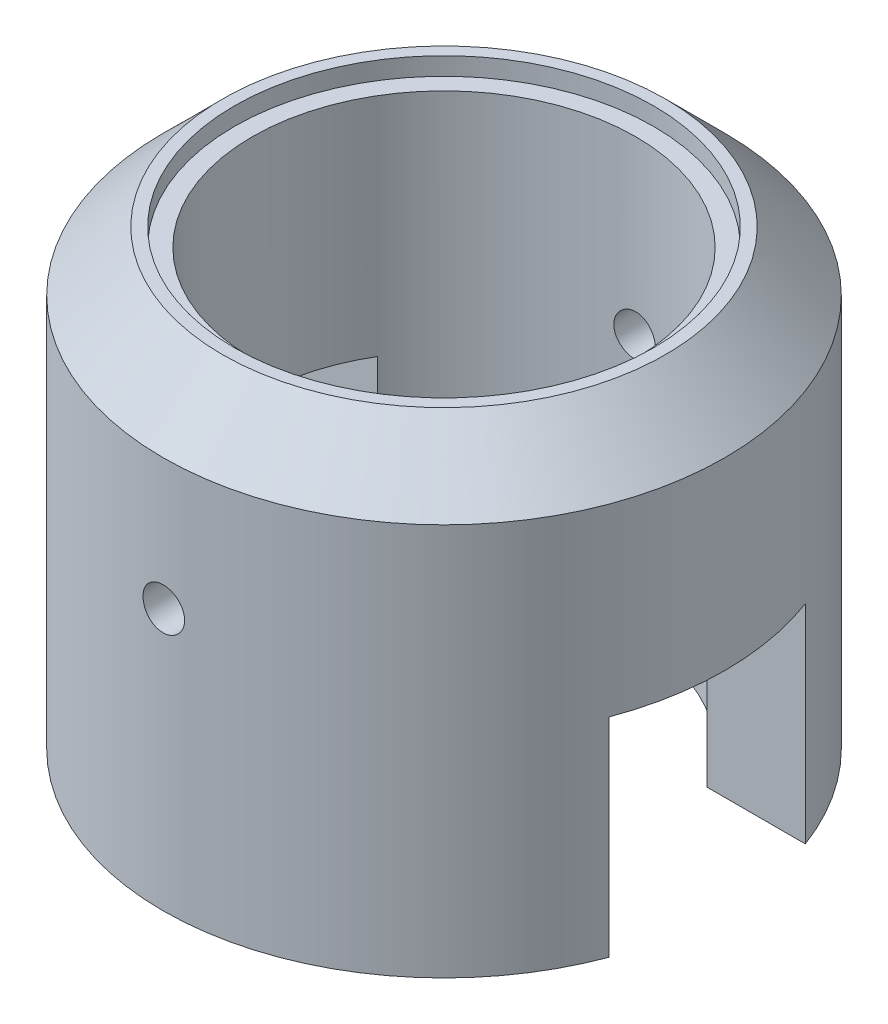
ISO-10303-21;
HEADER;
FILE_DESCRIPTION(('STEP AP214'),'2;1');
FILE_NAME('part.step','',(''),(''),'','','');
FILE_SCHEMA(('AUTOMOTIVE_DESIGN { 1 0 10303 214 1 1 1 1 }'));
ENDSEC;
DATA;
#1=APPLICATION_CONTEXT('core data for automotive mechanical design processes');
#2=APPLICATION_PROTOCOL_DEFINITION('international standard','automotive_design',2000,#1);
#3=PRODUCT_CONTEXT('',#1,'mechanical');
#4=PRODUCT('Part','Part','',(#3));
#5=PRODUCT_RELATED_PRODUCT_CATEGORY('part','',(#4));
#6=PRODUCT_DEFINITION_FORMATION('','',#4);
#7=PRODUCT_DEFINITION_CONTEXT('part definition',#1,'design');
#8=PRODUCT_DEFINITION('design','',#6,#7);
#9=PRODUCT_DEFINITION_SHAPE('','',#8);
#10=(LENGTH_UNIT() NAMED_UNIT(*) SI_UNIT(.MILLI.,.METRE.));
#11=(NAMED_UNIT(*) PLANE_ANGLE_UNIT() SI_UNIT($,.RADIAN.));
#12=(NAMED_UNIT(*) SI_UNIT($,.STERADIAN.) SOLID_ANGLE_UNIT());
#13=UNCERTAINTY_MEASURE_WITH_UNIT(LENGTH_MEASURE(1.E-05),#10,'distance_accuracy_value','');
#14=(GEOMETRIC_REPRESENTATION_CONTEXT(3) GLOBAL_UNCERTAINTY_ASSIGNED_CONTEXT((#13)) GLOBAL_UNIT_ASSIGNED_CONTEXT((#10,
#11,#12)) REPRESENTATION_CONTEXT('',''));
#15=CARTESIAN_POINT('',(0.,0.,0.));
#16=DIRECTION('',(0.,0.,1.));
#17=DIRECTION('',(1.,0.,0.));
#18=AXIS2_PLACEMENT_3D('',#15,#16,#17);
#19=CARTESIAN_POINT('',(-3.225,0.,0.));
#20=DIRECTION('',(0.,-1.,0.));
#21=DIRECTION('',(0.,0.,-1.));
#22=AXIS2_PLACEMENT_3D('',#19,#20,#21);
#23=PLANE('',#22);
#24=DIRECTION('',(1.,0.,0.));
#25=VECTOR('',#24,1.);
#26=CARTESIAN_POINT('',(-4.725,0.,1.65));
#27=LINE('',#26,#25);
#28=CARTESIAN_POINT('',(2.77094298028667,0.,1.65));
#29=VERTEX_POINT('',#28);
#30=CARTESIAN_POINT('',(4.42754164294363,0.,1.65));
#31=VERTEX_POINT('',#30);
#32=EDGE_CURVE('E198',#29,#31,#27,.T.);
#33=ORIENTED_EDGE('',*,*,#32,.T.);
#34=CARTESIAN_POINT('',(0.,0.,0.));
#35=DIRECTION('',(0.,1.,0.));
#36=DIRECTION('',(0.,0.,1.));
#37=AXIS2_PLACEMENT_3D('',#34,#35,#36);
#38=CIRCLE('',#37,4.725);
#39=CARTESIAN_POINT('',(-4.42754164294363,0.,1.65));
#40=VERTEX_POINT('',#39);
#41=EDGE_CURVE('E129',#40,#31,#38,.T.);
#42=ORIENTED_EDGE('',*,*,#41,.F.);
#43=CARTESIAN_POINT('',(-2.77094298028667,0.,1.65));
#44=VERTEX_POINT('',#43);
#45=EDGE_CURVE('E204',#40,#44,#27,.T.);
#46=ORIENTED_EDGE('',*,*,#45,.T.);
#47=CARTESIAN_POINT('',(0.,0.,0.));
#48=DIRECTION('',(0.,1.,0.));
#49=DIRECTION('',(0.,0.,1.));
#50=AXIS2_PLACEMENT_3D('',#47,#48,#49);
#51=CIRCLE('',#50,3.225);
#52=EDGE_CURVE('E201',#44,#29,#51,.T.);
#53=ORIENTED_EDGE('',*,*,#52,.T.);
#54=EDGE_LOOP('',(#33,#42,#46,#53));
#55=FACE_BOUND('',#54,.T.);
#56=ADVANCED_FACE('F33',(#55),#23,.T.);
#57=DIRECTION('',(1.,0.,0.));
#58=VECTOR('',#57,1.);
#59=CARTESIAN_POINT('',(-4.725,0.,-1.65));
#60=LINE('',#59,#58);
#61=CARTESIAN_POINT('',(-4.42754164294363,0.,-1.65));
#62=VERTEX_POINT('',#61);
#63=CARTESIAN_POINT('',(-2.77094298028667,0.,-1.65));
#64=VERTEX_POINT('',#63);
#65=EDGE_CURVE('E63',#62,#64,#60,.T.);
#66=ORIENTED_EDGE('',*,*,#65,.F.);
#67=CARTESIAN_POINT('',(4.42754164294363,0.,-1.65));
#68=VERTEX_POINT('',#67);
#69=EDGE_CURVE('E118',#68,#62,#38,.T.);
#70=ORIENTED_EDGE('',*,*,#69,.F.);
#71=CARTESIAN_POINT('',(2.77094298028667,0.,-1.65));
#72=VERTEX_POINT('',#71);
#73=EDGE_CURVE('E121',#72,#68,#60,.T.);
#74=ORIENTED_EDGE('',*,*,#73,.F.);
#75=EDGE_CURVE('E120',#72,#64,#51,.T.);
#76=ORIENTED_EDGE('',*,*,#75,.T.);
#77=EDGE_LOOP('',(#66,#70,#74,#76));
#78=FACE_BOUND('',#77,.T.);
#79=ADVANCED_FACE('F116',(#78),#23,.T.);
#80=CARTESIAN_POINT('',(0.,7.61175298804781,0.));
#81=DIRECTION('',(0.,1.,0.));
#82=DIRECTION('',(0.,0.,1.));
#83=AXIS2_PLACEMENT_3D('',#80,#81,#82);
#84=CYLINDRICAL_SURFACE('',#83,4.725);
#85=CARTESIAN_POINT('',(0.,4.75,-4.725));
#86=CARTESIAN_POINT('',(0.0196307803127665,4.74999913942152,-4.72499982895336));
#87=CARTESIAN_POINT('',(0.0392751075963471,4.74834287209261,-4.72487635491281));
#88=CARTESIAN_POINT('',(0.0780207681960014,4.74175978618799,-4.72439566360952));
#89=CARTESIAN_POINT('',(0.0971214519922923,4.73682921368375,-4.72403817806377));
#90=CARTESIAN_POINT('',(0.134213023646179,4.72384041682212,-4.72312988228226));
#91=CARTESIAN_POINT('',(0.152204512863294,4.71578390481228,-4.72257917790495));
#92=CARTESIAN_POINT('',(0.186575309976036,4.69677485287914,-4.72134628937063));
#93=CARTESIAN_POINT('',(0.20295497328738,4.68582295337577,-4.72066413429774));
#94=CARTESIAN_POINT('',(0.233675155712827,4.66130969199534,-4.71924339346657));
#95=CARTESIAN_POINT('',(0.248011930767776,4.64774364342597,-4.71850470781522));
#96=CARTESIAN_POINT('',(0.274207284634027,4.61839699100376,-4.71705500486471));
#97=CARTESIAN_POINT('',(0.286065757175712,4.60261629223518,-4.71634398875307));
#98=CARTESIAN_POINT('',(0.306980132976174,4.56926617932446,-4.71502900637774));
#99=CARTESIAN_POINT('',(0.316032814301538,4.55169473937465,-4.71442516352015));
#100=CARTESIAN_POINT('',(0.33105804268377,4.51527608825711,-4.71339395986477));
#101=CARTESIAN_POINT('',(0.3370306339014,4.49642889538486,-4.71296659653672));
#102=CARTESIAN_POINT('',(0.345715458183027,4.45803072741431,-4.71233752444842));
#103=CARTESIAN_POINT('',(0.34843370515483,4.43848111945937,-4.71213539950399));
#104=CARTESIAN_POINT('',(0.350551252407563,4.39920215404244,-4.71197835351203));
#105=CARTESIAN_POINT('',(0.349950603114992,4.37947279931603,-4.7120234287086));
#106=CARTESIAN_POINT('',(0.345452386791524,4.34043548388093,-4.71235531379366));
#107=CARTESIAN_POINT('',(0.341561341865507,4.32112676700682,-4.71264164546812));
#108=CARTESIAN_POINT('',(0.330602911789356,4.28343726877794,-4.71342302737734));
#109=CARTESIAN_POINT('',(0.323535501347106,4.26505649481331,-4.71391807927407));
#110=CARTESIAN_POINT('',(0.30641760662439,4.22972377754283,-4.71506166834972));
#111=CARTESIAN_POINT('',(0.296364180607715,4.21277326453412,-4.71571035675863));
#112=CARTESIAN_POINT('',(0.273561759878824,4.18079787039727,-4.7170879779194));
#113=CARTESIAN_POINT('',(0.260812722211317,4.16577301996121,-4.7178169119499));
#114=CARTESIAN_POINT('',(0.232944322668113,4.13803751739882,-4.71927501191702));
#115=CARTESIAN_POINT('',(0.217819319506647,4.12533253270445,-4.72000417417474));
#116=CARTESIAN_POINT('',(0.185648058523882,4.10264117868184,-4.72137888526351));
#117=CARTESIAN_POINT('',(0.168601799744055,4.09265481070996,-4.72202443405283));
#118=CARTESIAN_POINT('',(0.133068341912814,4.07568457975852,-4.72315926588532));
#119=CARTESIAN_POINT('',(0.114581030897263,4.06870095035527,-4.72364853677121));
#120=CARTESIAN_POINT('',(0.0766918711139293,4.0579383164885,-4.72441553355618));
#121=CARTESIAN_POINT('',(0.0572900373475552,4.05415925947795,-4.724693262924));
#122=CARTESIAN_POINT('',(0.0181717258235845,4.04992010966664,-4.72500543729125));
#123=CARTESIAN_POINT('',(-0.00154389883817433,4.04945218504665,-4.72504045636914));
#124=CARTESIAN_POINT('',(-0.0407733340047606,4.05182809159886,-4.72486479457418));
#125=CARTESIAN_POINT('',(-0.0602871459908696,4.05467189844591,-4.72465411550603));
#126=CARTESIAN_POINT('',(-0.0985368283666493,4.06358405454708,-4.72401113124348));
#127=CARTESIAN_POINT('',(-0.117273544988108,4.06964879131919,-4.72357907435776));
#128=CARTESIAN_POINT('',(-0.153463338515433,4.08482697217911,-4.72254190411821));
#129=CARTESIAN_POINT('',(-0.170916399281297,4.09394045459223,-4.72193678858891));
#130=CARTESIAN_POINT('',(-0.20407920188667,4.11497723265869,-4.72061997860076));
#131=CARTESIAN_POINT('',(-0.219785631637581,4.12690573705792,-4.71990808747158));
#132=CARTESIAN_POINT('',(-0.248975934858004,4.1532264010994,-4.71845843402075));
#133=CARTESIAN_POINT('',(-0.262459777777609,4.16761859460001,-4.71772067134367));
#134=CARTESIAN_POINT('',(-0.286848855518051,4.19849198766152,-4.71630074201573));
#135=CARTESIAN_POINT('',(-0.297748993839142,4.21497721914611,-4.71561868695898));
#136=CARTESIAN_POINT('',(-0.316626343580321,4.24954857205258,-4.71438889231751));
#137=CARTESIAN_POINT('',(-0.324603578882898,4.2676346803925,-4.71384115163536));
#138=CARTESIAN_POINT('',(-0.337399927005736,4.30487607020869,-4.71294257122809));
#139=CARTESIAN_POINT('',(-0.342222201707213,4.32403026029696,-4.71259153441842));
#140=CARTESIAN_POINT('',(-0.348582052043034,4.36287914327276,-4.71212541006648));
#141=CARTESIAN_POINT('',(-0.350119676077243,4.38257382819169,-4.71201031904751));
#142=CARTESIAN_POINT('',(-0.349866067244498,4.42189398487763,-4.71202915239115));
#143=CARTESIAN_POINT('',(-0.34808284389367,4.44151950909133,-4.71216247760172));
#144=CARTESIAN_POINT('',(-0.341254815690448,4.4801915876875,-4.71266184922942));
#145=CARTESIAN_POINT('',(-0.336210005369036,4.4992381410991,-4.71302789603679));
#146=CARTESIAN_POINT('',(-0.323003936548773,4.53621244560843,-4.71395131147182));
#147=CARTESIAN_POINT('',(-0.314842773235223,4.55414023085815,-4.71450867425592));
#148=CARTESIAN_POINT('',(-0.295636632013014,4.58837239046806,-4.71575192110457));
#149=CARTESIAN_POINT('',(-0.284591713428708,4.60467679821469,-4.71643780252516));
#150=CARTESIAN_POINT('',(-0.259901616747517,4.63524025700981,-4.71786275513291));
#151=CARTESIAN_POINT('',(-0.2462505536747,4.64949454841549,-4.71860194429817));
#152=CARTESIAN_POINT('',(-0.216745416526431,4.67551471966652,-4.72004916332084));
#153=CARTESIAN_POINT('',(-0.200890807423258,4.68727999341568,-4.72075718555568));
#154=CARTESIAN_POINT('',(-0.167404141902421,4.70800047135478,-4.72206330571603));
#155=CARTESIAN_POINT('',(-0.149769354110586,4.71695126791565,-4.72266123062214));
#156=CARTESIAN_POINT('',(-0.113255204290085,4.73175365974462,-4.72367764139401));
#157=CARTESIAN_POINT('',(-0.0943773146048871,4.73760884979475,-4.72409633528424));
#158=CARTESIAN_POINT('',(-0.062821701788874,4.74454789695185,-4.7245985474676));
#159=CARTESIAN_POINT('',(-0.0503474343481686,4.74658975366794,-4.72474841466728));
#160=CARTESIAN_POINT('',(-0.0252506463698005,4.74931608061696,-4.72494919584905));
#161=CARTESIAN_POINT('',(-0.0126281261319639,4.75000055359458,-4.72500011003121));
#162=CARTESIAN_POINT('',(0.,4.75,-4.725));
#163=B_SPLINE_CURVE_WITH_KNOTS('',3,(#85,#86,#87,#88,#89,#90,#91,#92,#93,#94,#95,#96,#97,#98,
#99,#100,#101,#102,#103,#104,#105,#106,#107,#108,#109,#110,#111,#112,#113,#114,#115,#116,#117,
#118,#119,#120,#121,#122,#123,#124,#125,#126,#127,#128,#129,#130,#131,#132,#133,#134,#135,#136,
#137,#138,#139,#140,#141,#142,#143,#144,#145,#146,#147,#148,#149,#150,#151,#152,#153,#154,#155,
#156,#157,#158,#159,#160,#161,#162),.UNSPECIFIED.,.T.,.F.,(4,2,2,2,2,2,2,2,2,2,2,2,2,2,2,2,2,2,
2,2,2,2,2,2,2,2,2,2,2,2,2,2,2,2,2,2,2,2,4),(0.,0.0588462375391481,0.11776005791259,
0.176641651547741,0.235510232263811,0.294485352395513,0.353463000861885,0.412508125480255,
0.471552403516166,0.530487400655326,0.589421502353008,0.648239060056712,0.707057086109188,
0.765933251274743,0.824810354718417,0.883829424711778,0.94284852415031,1.00187221372211,
1.06089493543327,1.11977800393315,1.17866063993099,1.23747737426431,1.29629484800141,
1.35522201935593,1.41415000060884,1.47319327083595,1.53223605862089,1.59121958309167,
1.65020223842457,1.70904281833676,1.76788349691289,1.82672237841412,1.88556004958255,
1.94453218908096,2.00351867229135,2.06259707679256,2.12160672479528,2.15946152225211,
2.19731624316468),.UNSPECIFIED.);
#164=CARTESIAN_POINT('',(0.,4.75,-4.725));
#165=VERTEX_POINT('',#164);
#166=EDGE_CURVE('E170',#165,#165,#163,.T.);
#167=ORIENTED_EDGE('',*,*,#166,.F.);
#168=EDGE_LOOP('',(#167));
#169=FACE_BOUND('',#168,.T.);
#170=CARTESIAN_POINT('',(0.,4.05,4.725));
#171=CARTESIAN_POINT('',(0.0196307803127665,4.05000086057848,4.72499982895336));
#172=CARTESIAN_POINT('',(0.039275107596347,4.05165712790739,4.72487635491281));
#173=CARTESIAN_POINT('',(0.0780207681960013,4.05824021381201,4.72439566360952));
#174=CARTESIAN_POINT('',(0.0971214519922923,4.06317078631625,4.72403817806377));
#175=CARTESIAN_POINT('',(0.134213023646179,4.07615958317788,4.72312988228226));
#176=CARTESIAN_POINT('',(0.152204512863294,4.08421609518772,4.72257917790495));
#177=CARTESIAN_POINT('',(0.186575309976036,4.10322514712086,4.72134628937063));
#178=CARTESIAN_POINT('',(0.20295497328738,4.11417704662423,4.72066413429774));
#179=CARTESIAN_POINT('',(0.233675155712827,4.13869030800466,4.71924339346657));
#180=CARTESIAN_POINT('',(0.248011930767776,4.15225635657403,4.71850470781522));
#181=CARTESIAN_POINT('',(0.274207284634027,4.18160300899624,4.71705500486471));
#182=CARTESIAN_POINT('',(0.286065757175712,4.19738370776482,4.71634398875307));
#183=CARTESIAN_POINT('',(0.306980132976174,4.23073382067554,4.71502900637774));
#184=CARTESIAN_POINT('',(0.316032814301539,4.24830526062535,4.71442516352015));
#185=CARTESIAN_POINT('',(0.33105804268377,4.28472391174289,4.71339395986477));
#186=CARTESIAN_POINT('',(0.3370306339014,4.30357110461514,4.71296659653672));
#187=CARTESIAN_POINT('',(0.345715458183027,4.34196927258569,4.71233752444842));
#188=CARTESIAN_POINT('',(0.34843370515483,4.36151888054063,4.71213539950399));
#189=CARTESIAN_POINT('',(0.350551252407563,4.40079784595756,4.71197835351203));
#190=CARTESIAN_POINT('',(0.349950603114992,4.42052720068398,4.7120234287086));
#191=CARTESIAN_POINT('',(0.345452386791524,4.45956451611907,4.71235531379366));
#192=CARTESIAN_POINT('',(0.341561341865507,4.47887323299318,4.71264164546812));
#193=CARTESIAN_POINT('',(0.330602911789356,4.51656273122206,4.71342302737734));
#194=CARTESIAN_POINT('',(0.323535501347106,4.53494350518669,4.71391807927407));
#195=CARTESIAN_POINT('',(0.30641760662439,4.57027622245717,4.71506166834972));
#196=CARTESIAN_POINT('',(0.296364180607715,4.58722673546588,4.71571035675863));
#197=CARTESIAN_POINT('',(0.273561759878824,4.61920212960273,4.7170879779194));
#198=CARTESIAN_POINT('',(0.260812722211317,4.63422698003879,4.7178169119499));
#199=CARTESIAN_POINT('',(0.232944322668113,4.66196248260118,4.71927501191702));
#200=CARTESIAN_POINT('',(0.217819319506647,4.67466746729555,4.72000417417474));
#201=CARTESIAN_POINT('',(0.185648058523882,4.69735882131816,4.72137888526351));
#202=CARTESIAN_POINT('',(0.168601799744055,4.70734518929004,4.72202443405283));
#203=CARTESIAN_POINT('',(0.133068341912814,4.72431542024148,4.72315926588532));
#204=CARTESIAN_POINT('',(0.114581030897263,4.73129904964473,4.72364853677121));
#205=CARTESIAN_POINT('',(0.0766918711139293,4.7420616835115,4.72441553355618));
#206=CARTESIAN_POINT('',(0.0572900373475552,4.74584074052206,4.724693262924));
#207=CARTESIAN_POINT('',(0.0181717258235845,4.75007989033336,4.72500543729125));
#208=CARTESIAN_POINT('',(-0.00154389883817433,4.75054781495335,4.72504045636914));
#209=CARTESIAN_POINT('',(-0.0407733340047606,4.74817190840114,4.72486479457418));
#210=CARTESIAN_POINT('',(-0.0602871459908695,4.74532810155409,4.72465411550603));
#211=CARTESIAN_POINT('',(-0.0985368283666494,4.73641594545292,4.72401113124348));
#212=CARTESIAN_POINT('',(-0.117273544988108,4.73035120868081,4.72357907435776));
#213=CARTESIAN_POINT('',(-0.153463338515433,4.71517302782089,4.72254190411821));
#214=CARTESIAN_POINT('',(-0.170916399281298,4.70605954540777,4.72193678858891));
#215=CARTESIAN_POINT('',(-0.20407920188667,4.68502276734131,4.72061997860076));
#216=CARTESIAN_POINT('',(-0.219785631637581,4.67309426294208,4.71990808747158));
#217=CARTESIAN_POINT('',(-0.248975934858004,4.6467735989006,4.71845843402075));
#218=CARTESIAN_POINT('',(-0.262459777777609,4.63238140539999,4.71772067134367));
#219=CARTESIAN_POINT('',(-0.286848855518051,4.60150801233848,4.71630074201573));
#220=CARTESIAN_POINT('',(-0.297748993839142,4.58502278085389,4.71561868695898));
#221=CARTESIAN_POINT('',(-0.316626343580321,4.55045142794742,4.71438889231751));
#222=CARTESIAN_POINT('',(-0.324603578882898,4.5323653196075,4.71384115163536));
#223=CARTESIAN_POINT('',(-0.337399927005736,4.49512392979132,4.71294257122809));
#224=CARTESIAN_POINT('',(-0.342222201707213,4.47596973970304,4.71259153441842));
#225=CARTESIAN_POINT('',(-0.348582052043034,4.43712085672724,4.71212541006648));
#226=CARTESIAN_POINT('',(-0.350119676077243,4.41742617180831,4.71201031904751));
#227=CARTESIAN_POINT('',(-0.349866067244498,4.37810601512237,4.71202915239115));
#228=CARTESIAN_POINT('',(-0.34808284389367,4.35848049090867,4.71216247760172));
#229=CARTESIAN_POINT('',(-0.341254815690448,4.3198084123125,4.71266184922942));
#230=CARTESIAN_POINT('',(-0.336210005369036,4.3007618589009,4.71302789603679));
#231=CARTESIAN_POINT('',(-0.323003936548773,4.26378755439157,4.71395131147182));
#232=CARTESIAN_POINT('',(-0.314842773235223,4.24585976914185,4.71450867425592));
#233=CARTESIAN_POINT('',(-0.295636632013014,4.21162760953194,4.71575192110457));
#234=CARTESIAN_POINT('',(-0.284591713428707,4.19532320178531,4.71643780252516));
#235=CARTESIAN_POINT('',(-0.259901616747517,4.16475974299019,4.71786275513291));
#236=CARTESIAN_POINT('',(-0.2462505536747,4.15050545158451,4.71860194429817));
#237=CARTESIAN_POINT('',(-0.216745416526431,4.12448528033348,4.72004916332084));
#238=CARTESIAN_POINT('',(-0.200890807423258,4.11272000658432,4.72075718555568));
#239=CARTESIAN_POINT('',(-0.167404141902422,4.09199952864522,4.72206330571603));
#240=CARTESIAN_POINT('',(-0.149769354110587,4.08304873208436,4.72266123062214));
#241=CARTESIAN_POINT('',(-0.113255204290085,4.06824634025538,4.72367764139401));
#242=CARTESIAN_POINT('',(-0.0943773146048872,4.06239115020525,4.72409633528424));
#243=CARTESIAN_POINT('',(-0.062821701788874,4.05545210304815,4.7245985474676));
#244=CARTESIAN_POINT('',(-0.0503474343481686,4.05341024633206,4.72474841466728));
#245=CARTESIAN_POINT('',(-0.0252506463698005,4.05068391938304,4.72494919584905));
#246=CARTESIAN_POINT('',(-0.0126281261319639,4.04999944640542,4.72500011003121));
#247=CARTESIAN_POINT('',(0.,4.05,4.725));
#248=B_SPLINE_CURVE_WITH_KNOTS('',3,(#170,#171,#172,#173,#174,#175,#176,#177,#178,#179,#180,
#181,#182,#183,#184,#185,#186,#187,#188,#189,#190,#191,#192,#193,#194,#195,#196,#197,#198,#199,
#200,#201,#202,#203,#204,#205,#206,#207,#208,#209,#210,#211,#212,#213,#214,#215,#216,#217,#218,
#219,#220,#221,#222,#223,#224,#225,#226,#227,#228,#229,#230,#231,#232,#233,#234,#235,#236,#237,
#238,#239,#240,#241,#242,#243,#244,#245,#246,#247),.UNSPECIFIED.,.T.,.F.,(4,2,2,2,2,2,2,2,2,2,2,
2,2,2,2,2,2,2,2,2,2,2,2,2,2,2,2,2,2,2,2,2,2,2,2,2,2,2,4),(0.,0.0588462375391479,
0.11776005791259,0.176641651547741,0.235510232263811,0.294485352395514,0.353463000861885,
0.412508125480255,0.471552403516166,0.530487400655326,0.589421502353008,0.648239060056712,
0.707057086109188,0.765933251274743,0.824810354718417,0.883829424711778,0.94284852415031,
1.00187221372211,1.06089493543327,1.11977800393315,1.17866063993099,1.23747737426431,
1.29629484800141,1.35522201935593,1.41415000060884,1.47319327083595,1.53223605862089,
1.59121958309167,1.65020223842457,1.70904281833676,1.76788349691289,1.82672237841412,
1.88556004958255,1.94453218908096,2.00351867229135,2.06259707679256,2.12160672479528,
2.15946152225211,2.19731624316468),.UNSPECIFIED.);
#249=CARTESIAN_POINT('',(0.,4.05,4.725));
#250=VERTEX_POINT('',#249);
#251=EDGE_CURVE('E176',#250,#250,#248,.T.);
#252=ORIENTED_EDGE('',*,*,#251,.F.);
#253=EDGE_LOOP('',(#252));
#254=FACE_BOUND('',#253,.T.);
#255=DIRECTION('',(0.,1.,0.));
#256=VECTOR('',#255,1.);
#257=CARTESIAN_POINT('',(-4.42754164294363,7.61175298804781,1.65));
#258=LINE('',#257,#256);
#259=CARTESIAN_POINT('',(-4.42754164294363,3.5,1.65));
#260=VERTEX_POINT('',#259);
#261=EDGE_CURVE('E208',#40,#260,#258,.T.);
#262=ORIENTED_EDGE('',*,*,#261,.F.);
#263=ORIENTED_EDGE('',*,*,#41,.T.);
#264=DIRECTION('',(0.,1.,0.));
#265=VECTOR('',#264,1.);
#266=CARTESIAN_POINT('',(4.42754164294363,7.61175298804781,1.65));
#267=LINE('',#266,#265);
#268=CARTESIAN_POINT('',(4.42754164294363,3.5,1.65));
#269=VERTEX_POINT('',#268);
#270=EDGE_CURVE('E207',#269,#31,#267,.F.);
#271=ORIENTED_EDGE('',*,*,#270,.F.);
#272=CARTESIAN_POINT('',(0.,3.5,0.));
#273=DIRECTION('',(0.,1.,0.));
#274=DIRECTION('',(0.,0.,1.));
#275=AXIS2_PLACEMENT_3D('',#272,#273,#274);
#276=CIRCLE('',#275,4.725);
#277=CARTESIAN_POINT('',(4.42754164294363,3.5,-1.65));
#278=VERTEX_POINT('',#277);
#279=EDGE_CURVE('E110',#278,#269,#276,.F.);
#280=ORIENTED_EDGE('',*,*,#279,.F.);
#281=DIRECTION('',(0.,1.,0.));
#282=VECTOR('',#281,1.);
#283=CARTESIAN_POINT('',(4.42754164294363,7.61175298804781,-1.65));
#284=LINE('',#283,#282);
#285=EDGE_CURVE('E111',#68,#278,#284,.T.);
#286=ORIENTED_EDGE('',*,*,#285,.F.);
#287=ORIENTED_EDGE('',*,*,#69,.T.);
#288=DIRECTION('',(0.,1.,0.));
#289=VECTOR('',#288,1.);
#290=CARTESIAN_POINT('',(-4.42754164294363,7.61175298804781,-1.65));
#291=LINE('',#290,#289);
#292=CARTESIAN_POINT('',(-4.42754164294363,3.5,-1.65));
#293=VERTEX_POINT('',#292);
#294=EDGE_CURVE('E103',#293,#62,#291,.F.);
#295=ORIENTED_EDGE('',*,*,#294,.F.);
#296=EDGE_CURVE('E209',#260,#293,#276,.F.);
#297=ORIENTED_EDGE('',*,*,#296,.F.);
#298=EDGE_LOOP('',(#262,#263,#271,#280,#286,#287,#295,#297));
#299=FACE_BOUND('',#298,.T.);
#300=CARTESIAN_POINT('',(0.,6.6,0.));
#301=DIRECTION('',(0.,1.,0.));
#302=DIRECTION('',(0.,0.,1.));
#303=AXIS2_PLACEMENT_3D('',#300,#301,#302);
#304=CIRCLE('',#303,4.725);
#305=CARTESIAN_POINT('',(0.,6.6,4.725));
#306=VERTEX_POINT('',#305);
#307=EDGE_CURVE('E132',#306,#306,#304,.F.);
#308=ORIENTED_EDGE('',*,*,#307,.T.);
#309=EDGE_LOOP('',(#308));
#310=FACE_BOUND('',#309,.T.);
#311=ADVANCED_FACE('F125',(#169,#254,#299,#310),#84,.T.);
#312=CARTESIAN_POINT('',(-4.725,7.6,0.));
#313=DIRECTION('',(0.,1.,0.));
#314=DIRECTION('',(0.,0.,1.));
#315=AXIS2_PLACEMENT_3D('',#312,#313,#314);
#316=PLANE('',#315);
#317=CARTESIAN_POINT('',(0.,7.6,0.));
#318=DIRECTION('',(0.,1.,0.));
#319=DIRECTION('',(0.,0.,1.));
#320=AXIS2_PLACEMENT_3D('',#317,#318,#319);
#321=CIRCLE('',#320,3.725);
#322=CARTESIAN_POINT('',(0.,7.6,3.725));
#323=VERTEX_POINT('',#322);
#324=EDGE_CURVE('E128',#323,#323,#321,.T.);
#325=ORIENTED_EDGE('',*,*,#324,.T.);
#326=EDGE_LOOP('',(#325));
#327=FACE_BOUND('',#326,.T.);
#328=CARTESIAN_POINT('',(0.,7.6,0.));
#329=DIRECTION('',(0.,1.,0.));
#330=DIRECTION('',(0.,0.,1.));
#331=AXIS2_PLACEMENT_3D('',#328,#329,#330);
#332=CIRCLE('',#331,3.525);
#333=CARTESIAN_POINT('',(0.,7.6,3.525));
#334=VERTEX_POINT('',#333);
#335=EDGE_CURVE('E135',#334,#334,#332,.T.);
#336=ORIENTED_EDGE('',*,*,#335,.F.);
#337=EDGE_LOOP('',(#336));
#338=FACE_BOUND('',#337,.T.);
#339=ADVANCED_FACE('F184',(#327,#338),#316,.T.);
#340=CARTESIAN_POINT('',(0.,7.61175298804781,0.));
#341=DIRECTION('',(0.,1.,0.));
#342=DIRECTION('',(0.,0.,1.));
#343=AXIS2_PLACEMENT_3D('',#340,#341,#342);
#344=CYLINDRICAL_SURFACE('',#343,3.525);
#345=ORIENTED_EDGE('',*,*,#335,.T.);
#346=EDGE_LOOP('',(#345));
#347=FACE_BOUND('',#346,.T.);
#348=CARTESIAN_POINT('',(0.,7.3,0.));
#349=DIRECTION('',(0.,1.,0.));
#350=DIRECTION('',(0.,0.,1.));
#351=AXIS2_PLACEMENT_3D('',#348,#349,#350);
#352=CIRCLE('',#351,3.525);
#353=CARTESIAN_POINT('',(0.,7.3,3.525));
#354=VERTEX_POINT('',#353);
#355=EDGE_CURVE('E220',#354,#354,#352,.T.);
#356=ORIENTED_EDGE('',*,*,#355,.F.);
#357=EDGE_LOOP('',(#356));
#358=FACE_BOUND('',#357,.T.);
#359=ADVANCED_FACE('F227',(#347,#358),#344,.F.);
#360=CARTESIAN_POINT('',(-3.525,7.3,0.));
#361=DIRECTION('',(0.,1.,0.));
#362=DIRECTION('',(0.,0.,1.));
#363=AXIS2_PLACEMENT_3D('',#360,#361,#362);
#364=PLANE('',#363);
#365=ORIENTED_EDGE('',*,*,#355,.T.);
#366=EDGE_LOOP('',(#365));
#367=FACE_BOUND('',#366,.T.);
#368=CARTESIAN_POINT('',(0.,7.3,0.));
#369=DIRECTION('',(0.,1.,0.));
#370=DIRECTION('',(0.,0.,1.));
#371=AXIS2_PLACEMENT_3D('',#368,#369,#370);
#372=CIRCLE('',#371,3.225);
#373=CARTESIAN_POINT('',(0.,7.3,3.225));
#374=VERTEX_POINT('',#373);
#375=EDGE_CURVE('E218',#374,#374,#372,.T.);
#376=ORIENTED_EDGE('',*,*,#375,.F.);
#377=EDGE_LOOP('',(#376));
#378=FACE_BOUND('',#377,.T.);
#379=ADVANCED_FACE('F235',(#367,#378),#364,.T.);
#380=CARTESIAN_POINT('',(0.,7.61175298804781,0.));
#381=DIRECTION('',(0.,1.,0.));
#382=DIRECTION('',(0.,0.,1.));
#383=AXIS2_PLACEMENT_3D('',#380,#381,#382);
#384=CYLINDRICAL_SURFACE('',#383,3.225);
#385=CARTESIAN_POINT('',(0.,4.05,3.225));
#386=CARTESIAN_POINT('',(-0.0195978257264568,4.0500008439481,3.22499975745281));
#387=CARTESIAN_POINT('',(-0.0392083842261659,4.05165157928419,3.22481946600589));
#388=CARTESIAN_POINT('',(-0.0778851827957588,4.05821140687677,3.22411758585404));
#389=CARTESIAN_POINT('',(-0.096950809707046,4.06312402966239,3.22359562735179));
#390=CARTESIAN_POINT('',(-0.13397211433738,4.07606237825496,3.22226929546476));
#391=CARTESIAN_POINT('',(-0.15192847868854,4.08408615541567,3.22146509888735));
#392=CARTESIAN_POINT('',(-0.1862358840696,4.10301510601141,3.21966406171853));
#393=CARTESIAN_POINT('',(-0.202587229565288,4.11391973150639,3.2186672577709));
#394=CARTESIAN_POINT('',(-0.233292930701064,4.13834995977915,3.21658786477287));
#395=CARTESIAN_POINT('',(-0.247639581939473,4.15188522080208,3.21550496857247));
#396=CARTESIAN_POINT('',(-0.273862380092046,4.18117184521221,3.21337795959126));
#397=CARTESIAN_POINT('',(-0.285738409200634,4.19692331421388,3.21233384866179));
#398=CARTESIAN_POINT('',(-0.306710632099718,4.23024410166153,3.21039953645401));
#399=CARTESIAN_POINT('',(-0.315799768048098,4.24781788712454,3.2095097283828));
#400=CARTESIAN_POINT('',(-0.330895131084699,4.28425356374858,3.20798867114231));
#401=CARTESIAN_POINT('',(-0.336901447113741,4.30311541773041,3.20735741451381));
#402=CARTESIAN_POINT('',(-0.345637629638677,4.3415127225185,3.20642777111572));
#403=CARTESIAN_POINT('',(-0.348380359663222,4.36104521443552,3.20612807780917));
#404=CARTESIAN_POINT('',(-0.35055129082921,4.40029540195232,3.20589145964697));
#405=CARTESIAN_POINT('',(-0.349979593641544,4.42001309185257,3.20595452366366));
#406=CARTESIAN_POINT('',(-0.345548487023933,4.45898498337646,3.20643510035808));
#407=CARTESIAN_POINT('',(-0.341703161813081,4.47824080774265,3.20685109458823));
#408=CARTESIAN_POINT('',(-0.330855887614246,4.51583218119189,3.2079882896528));
#409=CARTESIAN_POINT('',(-0.323853889187416,4.53416771585663,3.20870949526732));
#410=CARTESIAN_POINT('',(-0.306876612825876,4.56944228983861,3.21037759189797));
#411=CARTESIAN_POINT('',(-0.296895126905914,4.58637831816996,3.21132495329302));
#412=CARTESIAN_POINT('',(-0.274246667499726,4.6183401650811,3.21333823250725));
#413=CARTESIAN_POINT('',(-0.261579601382064,4.63336591774277,3.21440415441523));
#414=CARTESIAN_POINT('',(-0.23384108171048,4.661162501009,3.21654121521648));
#415=CARTESIAN_POINT('',(-0.218757472059324,4.67392120417841,3.21761235242639));
#416=CARTESIAN_POINT('',(-0.186656131140233,4.6967273832559,3.219633938536));
#417=CARTESIAN_POINT('',(-0.169638397074953,4.70677485524263,3.22058438726114));
#418=CARTESIAN_POINT('',(-0.134143175197159,4.72387303094949,3.22225790137195));
#419=CARTESIAN_POINT('',(-0.115665366542379,4.73092307381948,3.22298091660569));
#420=CARTESIAN_POINT('',(-0.077778675889027,4.74181714532163,3.22411760928316));
#421=CARTESIAN_POINT('',(-0.0583698267281554,4.7456612869378,3.2245312976283));
#422=CARTESIAN_POINT('',(-0.0192769724355813,4.75001894449306,3.22500131994106));
#423=CARTESIAN_POINT('',(0.000405147593880948,4.75054918618112,3.22505944844073));
#424=CARTESIAN_POINT('',(0.0395779683098623,4.74830798838529,3.22481662404654));
#425=CARTESIAN_POINT('',(0.0590686720462853,4.74553660159375,3.22451567688335));
#426=CARTESIAN_POINT('',(0.0972567745413006,4.73678469878291,3.22358965381632));
#427=CARTESIAN_POINT('',(0.115955999457192,4.73081205970133,3.22296537362578));
#428=CARTESIAN_POINT('',(0.152087221970465,4.71583531827839,3.22146267171258));
#429=CARTESIAN_POINT('',(0.169519186409548,4.70683113665036,3.22058424334305));
#430=CARTESIAN_POINT('',(0.202696390102015,4.68600574691704,3.21866692212348));
#431=CARTESIAN_POINT('',(0.218434728884995,4.67417360334418,3.21762741201274));
#432=CARTESIAN_POINT('',(0.247707964960886,4.64804377378471,3.21550642688786));
#433=CARTESIAN_POINT('',(0.261242796871475,4.63374601466442,3.21442495062969));
#434=CARTESIAN_POINT('',(0.285783292570966,4.60301761049848,3.21233647826933));
#435=CARTESIAN_POINT('',(0.29677794379659,4.58657814439387,3.21132981884721));
#436=CARTESIAN_POINT('',(0.315850157569023,4.55207626561397,3.20951022041882));
#437=CARTESIAN_POINT('',(0.32392776605946,4.53401387850538,3.20869727836155));
#438=CARTESIAN_POINT('',(0.336918355404544,4.49681594067082,3.20735933007705));
#439=CARTESIAN_POINT('',(0.341837779635925,4.4776826621142,3.20683373792148));
#440=CARTESIAN_POINT('',(0.348393215944897,4.43885562662184,3.20612822777573));
#441=CARTESIAN_POINT('',(0.350029340523448,4.41916188891346,3.20594829794157));
#442=CARTESIAN_POINT('',(0.34997001450109,4.3798824516433,3.20595476614561));
#443=CARTESIAN_POINT('',(0.348291862875006,4.36029672335795,3.2061392620523));
#444=CARTESIAN_POINT('',(0.34168800662934,4.32168726214058,3.20684972751314));
#445=CARTESIAN_POINT('',(0.336762299276003,4.30266352968166,3.20737569735475));
#446=CARTESIAN_POINT('',(0.32380813539394,4.26571889575422,3.2087093005986));
#447=CARTESIAN_POINT('',(0.315780292170381,4.2477977771057,3.20951687832271));
#448=CARTESIAN_POINT('',(0.296851480997618,4.21355445528746,3.21132281061908));
#449=CARTESIAN_POINT('',(0.28595051248576,4.19723225243087,3.2123211652287));
#450=CARTESIAN_POINT('',(0.261520120417517,4.16656147087776,3.21440240947459));
#451=CARTESIAN_POINT('',(0.247977794382843,4.1522231961188,3.21548569779543));
#452=CARTESIAN_POINT('',(0.218675262327659,4.12601543633854,3.21761113999967));
#453=CARTESIAN_POINT('',(0.202914528670453,4.11414654031524,3.21865328402139));
#454=CARTESIAN_POINT('',(0.169571359368531,4.09318638002661,3.22058225013662));
#455=CARTESIAN_POINT('',(0.151983749542348,4.08410330986021,3.22146861081267));
#456=CARTESIAN_POINT('',(0.115534099165229,4.06903178768258,3.22298126514787));
#457=CARTESIAN_POINT('',(0.0966735058018402,4.06303988632686,3.22360784853085));
#458=CARTESIAN_POINT('',(0.0647574446238091,4.05579608996465,3.22437491788132));
#459=CARTESIAN_POINT('',(0.0519051884833692,4.0536255740622,3.22460821528022));
#460=CARTESIAN_POINT('',(0.0260371613784482,4.05072725236628,3.22492083652694));
#461=CARTESIAN_POINT('',(0.0130213912436693,4.04999943925523,3.22500016115572));
#462=CARTESIAN_POINT('',(0.,4.05,3.225));
#463=B_SPLINE_CURVE_WITH_KNOTS('',3,(#385,#386,#387,#388,#389,#390,#391,#392,#393,#394,#395,
#396,#397,#398,#399,#400,#401,#402,#403,#404,#405,#406,#407,#408,#409,#410,#411,#412,#413,#414,
#415,#416,#417,#418,#419,#420,#421,#422,#423,#424,#425,#426,#427,#428,#429,#430,#431,#432,#433,
#434,#435,#436,#437,#438,#439,#440,#441,#442,#443,#444,#445,#446,#447,#448,#449,#450,#451,#452,
#453,#454,#455,#456,#457,#458,#459,#460,#461,#462),.UNSPECIFIED.,.T.,.F.,(4,2,2,2,2,2,2,2,2,2,2,
2,2,2,2,2,2,2,2,2,2,2,2,2,2,2,2,2,2,2,2,2,2,2,2,2,2,2,4),(0.,0.0587459236828989,
0.117555535346317,0.176328371434924,0.235090036913056,0.294071663538388,0.353056101914095,
0.41218870829211,0.471319608570384,0.530216662222324,0.589111909201849,0.647755042702099,
0.706399094685011,0.765166199117644,0.823935330883958,0.883009953528354,0.942084661614094,
1.00117238729217,1.06025803048253,1.11904521714224,1.1778314656001,1.23647372540168,
1.29511751904593,1.3539918601482,1.41286794784807,1.47199468476141,1.53112049038387,
1.59012528000459,1.64912804781504,1.70782366257152,1.76651932673735,1.82520339245842,
1.88388746967175,1.94286572961281,2.00185804100409,2.06102224141215,2.1201202786438,
2.15915305436602,2.19818563210821),.UNSPECIFIED.);
#464=CARTESIAN_POINT('',(0.,4.05,3.225));
#465=VERTEX_POINT('',#464);
#466=EDGE_CURVE('E37',#465,#465,#463,.T.);
#467=ORIENTED_EDGE('',*,*,#466,.F.);
#468=EDGE_LOOP('',(#467));
#469=FACE_BOUND('',#468,.T.);
#470=CARTESIAN_POINT('',(0.35,4.4,-3.20595149682586));
#471=CARTESIAN_POINT('',(0.349999155710907,4.41959744253314,-3.20595174475069));
#472=CARTESIAN_POINT('',(0.348348482746948,4.43920761901834,-3.20613312841295));
#473=CARTESIAN_POINT('',(0.341788925414885,4.47788362389009,-3.20683890962964));
#474=CARTESIAN_POINT('',(0.336876509183952,4.49694883881741,-3.20736367899815));
#475=CARTESIAN_POINT('',(0.323938764801328,4.53396927220951,-3.20869610672547));
#476=CARTESIAN_POINT('',(0.315915395108412,4.55192518079461,-3.20950358707643));
#477=CARTESIAN_POINT('',(0.296987404140263,4.58623182217443,-3.21131023664456));
#478=CARTESIAN_POINT('',(0.286083329808249,4.60258285886976,-3.2123093694639));
#479=CARTESIAN_POINT('',(0.261653658873895,4.63328890731814,-3.21439150968505));
#480=CARTESIAN_POINT('',(0.248118280835828,4.64763611718659,-3.21547482069483));
#481=CARTESIAN_POINT('',(0.218831187654481,4.67385999390002,-3.21760050873738));
#482=CARTESIAN_POINT('',(0.20307936842321,4.68573654465354,-3.21864288384479));
#483=CARTESIAN_POINT('',(0.169758272741348,4.70670931412971,-3.22057229293847));
#484=CARTESIAN_POINT('',(0.152184589509958,4.71579857051386,-3.221458935603));
#485=CARTESIAN_POINT('',(0.1157491350431,4.73089418439275,-3.22297366310937));
#486=CARTESIAN_POINT('',(0.096887400394007,4.73690062941179,-3.22360175529163));
#487=CARTESIAN_POINT('',(0.0584904665219155,4.74563707985977,-3.22452647899051));
#488=CARTESIAN_POINT('',(0.0389582286877439,4.74837996064614,-3.22482441272087));
#489=CARTESIAN_POINT('',(-0.00029146092807464,4.75055128137436,-3.22505968554619));
#490=CARTESIAN_POINT('',(-0.0200089071021841,4.74997982134336,-3.22499703552361));
#491=CARTESIAN_POINT('',(-0.0589818416895719,4.74554909125345,-3.22451926161994));
#492=CARTESIAN_POINT('',(-0.0782389248996383,4.74170366664678,-3.22410562208272));
#493=CARTESIAN_POINT('',(-0.115832764678639,4.73085575772015,-3.22297404078457));
#494=CARTESIAN_POINT('',(-0.1341695074887,4.7238532262178,-3.22225609447584));
#495=CARTESIAN_POINT('',(-0.169445550087576,4.7068748439308,-3.22059404343587));
#496=CARTESIAN_POINT('',(-0.186381899010303,4.69689290917986,-3.21964947672573));
#497=CARTESIAN_POINT('',(-0.218344196963831,4.67424349067528,-3.21764007613934));
#498=CARTESIAN_POINT('',(-0.233370079918499,4.66157591407535,-3.21657523810574));
#499=CARTESIAN_POINT('',(-0.261166090504695,4.63383703101459,-3.21443821125316));
#500=CARTESIAN_POINT('',(-0.27392419365693,4.61875367300772,-3.21336601283304));
#501=CARTESIAN_POINT('',(-0.296729281832194,4.58665304981789,-3.21134056500054));
#502=CARTESIAN_POINT('',(-0.306776261683199,4.56963578094569,-3.21038731581507));
#503=CARTESIAN_POINT('',(-0.323874082852649,4.53414068778608,-3.20870764711751));
#504=CARTESIAN_POINT('',(-0.330924111816269,4.51566246910066,-3.20798128912076));
#505=CARTESIAN_POINT('',(-0.341818029979459,4.47777488679114,-3.20683889630034));
#506=CARTESIAN_POINT('',(-0.345662034667392,4.45836555673444,-3.20642285029858));
#507=CARTESIAN_POINT('',(-0.350019175432791,4.4192724744763,-3.20595016233318));
#508=CARTESIAN_POINT('',(-0.350549165274035,4.39959062183252,-3.20589170186467));
#509=CARTESIAN_POINT('',(-0.3483075592188,4.36041839629075,-3.20613600233131));
#510=CARTESIAN_POINT('',(-0.345536016030649,4.34092802034088,-3.20643875749973));
#511=CARTESIAN_POINT('',(-0.33678414732578,4.30274157007158,-3.20736972077175));
#512=CARTESIAN_POINT('',(-0.330811851517643,4.28404363388233,-3.2079971143217));
#513=CARTESIAN_POINT('',(-0.315836227968545,4.24791483706248,-3.20950600307286));
#514=CARTESIAN_POINT('',(-0.306832818911455,4.23048401044008,-3.21038750509098));
#515=CARTESIAN_POINT('',(-0.286008570292069,4.19730758909736,-3.2123096764438));
#516=CARTESIAN_POINT('',(-0.274176599085492,4.18156901817036,-3.21335096867489));
#517=CARTESIAN_POINT('',(-0.248046977668099,4.15229523348597,-3.21547338233352));
#518=CARTESIAN_POINT('',(-0.233749255465468,4.13876008408366,-3.21655450492326));
#519=CARTESIAN_POINT('',(-0.203020714189214,4.11421889217885,-3.21864028575763));
#520=CARTESIAN_POINT('',(-0.186581067202969,4.10322386981406,-3.2196445986278));
#521=CARTESIAN_POINT('',(-0.152078726727612,4.08415100502742,-3.22145853236738));
#522=CARTESIAN_POINT('',(-0.134016058880867,4.07607311652743,-3.22226815631197));
#523=CARTESIAN_POINT('',(-0.096818290048538,4.063082344197,-3.22359993930344));
#524=CARTESIAN_POINT('',(-0.0776855039011295,4.05816289564997,-3.22412269426745));
#525=CARTESIAN_POINT('',(-0.0388595077320133,4.05160724389385,-3.22482429421803));
#526=CARTESIAN_POINT('',(-0.0191663164850541,4.04997093082384,-3.2250031507122));
#527=CARTESIAN_POINT('',(0.0201134363518553,4.05002970273892,-3.22499678050813));
#528=CARTESIAN_POINT('',(0.0397000260098582,4.05170771718619,-3.22481341942111));
#529=CARTESIAN_POINT('',(0.0783112444695596,4.05831160189595,-3.22410690417231));
#530=CARTESIAN_POINT('',(0.0973358730604427,4.06323747337684,-3.22358374988305));
#531=CARTESIAN_POINT('',(0.134282318500671,4.07619230829302,-3.22225622743824));
#532=CARTESIAN_POINT('',(0.152204348837332,4.0842206688122,-3.22145191392411));
#533=CARTESIAN_POINT('',(0.186449278470863,4.1031507971551,-3.21965154129879));
#534=CARTESIAN_POINT('',(0.202772178020608,4.11405256452444,-3.21865548221792));
#535=CARTESIAN_POINT('',(0.233442931110518,4.13848384032489,-3.21657694470113));
#536=CARTESIAN_POINT('',(0.247780625829456,4.15202606818551,-3.21549406352636));
#537=CARTESIAN_POINT('',(0.273987261139728,4.18132816452934,-3.21336728763002));
#538=CARTESIAN_POINT('',(0.285855611206181,4.19708856196364,-3.21232340228286));
#539=CARTESIAN_POINT('',(0.306815177992706,4.23043145224245,-3.21038952441211));
#540=CARTESIAN_POINT('',(0.315898104088946,4.24801917995314,-3.20949999466424));
#541=CARTESIAN_POINT('',(0.330969324350744,4.2844690793068,-3.20798101676175));
#542=CARTESIAN_POINT('',(0.336961069743773,4.30332980294931,-3.20735127871421));
#543=CARTESIAN_POINT('',(0.34420443072793,4.33524544765193,-3.20658014311909));
#544=CARTESIAN_POINT('',(0.346374750650509,4.34809712630644,-3.20634553408914));
#545=CARTESIAN_POINT('',(0.349272812028832,4.3739639967558,-3.20603112898116));
#546=CARTESIAN_POINT('',(0.35000056095737,4.38697918770328,-3.20595133210118));
#547=CARTESIAN_POINT('',(0.35,4.4,-3.20595149682586));
#548=B_SPLINE_CURVE_WITH_KNOTS('',3,(#470,#471,#472,#473,#474,#475,#476,#477,#478,#479,#480,
#481,#482,#483,#484,#485,#486,#487,#488,#489,#490,#491,#492,#493,#494,#495,#496,#497,#498,#499,
#500,#501,#502,#503,#504,#505,#506,#507,#508,#509,#510,#511,#512,#513,#514,#515,#516,#517,#518,
#519,#520,#521,#522,#523,#524,#525,#526,#527,#528,#529,#530,#531,#532,#533,#534,#535,#536,#537,
#538,#539,#540,#541,#542,#543,#544,#545,#546,#547),.UNSPECIFIED.,.T.,.F.,(4,2,2,2,2,2,2,2,2,2,2,
2,2,2,2,2,2,2,2,2,2,2,2,2,2,2,2,2,2,2,2,2,2,2,2,2,2,2,4),(0.,0.0587447726108663,
0.117553258872921,0.176324782998891,0.235085156514918,0.294068289558001,0.353054193478171,
0.412186259232345,0.471316646071576,0.530212970939846,0.589107518320213,0.647754233355519,
0.706401824884458,0.765170004276611,0.823940215695741,0.883013308624355,0.942086514246217,
1.00117572208273,1.06026280129825,1.11904914104099,1.17783454228394,1.23647315458303,
1.29511334011431,1.35398821404961,1.41286480722856,1.47199222609034,1.53111871095276,
1.59012190202108,1.64912311868034,1.70782124028157,1.76651938390267,1.8252061262671,
1.88389285935116,1.94286960808807,2.00186044449347,2.06102519604564,2.12012374786751,
2.15915479075328,2.19818563145029),.UNSPECIFIED.);
#549=CARTESIAN_POINT('',(0.35,4.4,-3.20595149682586));
#550=VERTEX_POINT('',#549);
#551=EDGE_CURVE('E148',#550,#550,#548,.T.);
#552=ORIENTED_EDGE('',*,*,#551,.F.);
#553=EDGE_LOOP('',(#552));
#554=FACE_BOUND('',#553,.T.);
#555=DIRECTION('',(0.,1.,0.));
#556=VECTOR('',#555,1.);
#557=CARTESIAN_POINT('',(-2.77094298028667,7.61175298804781,1.65));
#558=LINE('',#557,#556);
#559=CARTESIAN_POINT('',(-2.77094298028667,3.5,1.65));
#560=VERTEX_POINT('',#559);
#561=EDGE_CURVE('E11',#560,#44,#558,.F.);
#562=ORIENTED_EDGE('',*,*,#561,.F.);
#563=CARTESIAN_POINT('',(0.,3.5,0.));
#564=DIRECTION('',(0.,1.,0.));
#565=DIRECTION('',(0.,0.,1.));
#566=AXIS2_PLACEMENT_3D('',#563,#564,#565);
#567=CIRCLE('',#566,3.225);
#568=CARTESIAN_POINT('',(-2.77094298028667,3.5,-1.65));
#569=VERTEX_POINT('',#568);
#570=EDGE_CURVE('E47',#569,#560,#567,.T.);
#571=ORIENTED_EDGE('',*,*,#570,.F.);
#572=DIRECTION('',(0.,1.,0.));
#573=VECTOR('',#572,1.);
#574=CARTESIAN_POINT('',(-2.77094298028667,7.61175298804781,-1.65));
#575=LINE('',#574,#573);
#576=EDGE_CURVE('E147',#64,#569,#575,.T.);
#577=ORIENTED_EDGE('',*,*,#576,.F.);
#578=ORIENTED_EDGE('',*,*,#75,.F.);
#579=DIRECTION('',(0.,1.,0.));
#580=VECTOR('',#579,1.);
#581=CARTESIAN_POINT('',(2.77094298028667,7.61175298804781,-1.65));
#582=LINE('',#581,#580);
#583=CARTESIAN_POINT('',(2.77094298028667,3.5,-1.65));
#584=VERTEX_POINT('',#583);
#585=EDGE_CURVE('E141',#584,#72,#582,.F.);
#586=ORIENTED_EDGE('',*,*,#585,.F.);
#587=CARTESIAN_POINT('',(2.77094298028667,3.5,1.65));
#588=VERTEX_POINT('',#587);
#589=EDGE_CURVE('E143',#588,#584,#567,.T.);
#590=ORIENTED_EDGE('',*,*,#589,.F.);
#591=DIRECTION('',(0.,1.,0.));
#592=VECTOR('',#591,1.);
#593=CARTESIAN_POINT('',(2.77094298028667,7.61175298804781,1.65));
#594=LINE('',#593,#592);
#595=EDGE_CURVE('E145',#29,#588,#594,.T.);
#596=ORIENTED_EDGE('',*,*,#595,.F.);
#597=ORIENTED_EDGE('',*,*,#52,.F.);
#598=EDGE_LOOP('',(#562,#571,#577,#578,#586,#590,#596,#597));
#599=FACE_BOUND('',#598,.T.);
#600=ORIENTED_EDGE('',*,*,#375,.T.);
#601=EDGE_LOOP('',(#600));
#602=FACE_BOUND('',#601,.T.);
#603=ADVANCED_FACE('F153',(#469,#554,#599,#602),#384,.F.);
#604=CARTESIAN_POINT('',(0.,7.6,0.));
#605=DIRECTION('',(0.,-1.,0.));
#606=DIRECTION('',(0.,0.,-1.));
#607=AXIS2_PLACEMENT_3D('',#604,#605,#606);
#608=CONICAL_SURFACE('',#607,3.725,0.785398163397446);
#609=ORIENTED_EDGE('',*,*,#307,.F.);
#610=EDGE_LOOP('',(#609));
#611=FACE_BOUND('',#610,.T.);
#612=ORIENTED_EDGE('',*,*,#324,.F.);
#613=EDGE_LOOP('',(#612));
#614=FACE_BOUND('',#613,.T.);
#615=ADVANCED_FACE('F35',(#611,#614),#608,.T.);
#616=CARTESIAN_POINT('',(-4.725,0.,-1.65));
#617=DIRECTION('',(0.,0.,-1.));
#618=DIRECTION('',(-1.,0.,0.));
#619=AXIS2_PLACEMENT_3D('',#616,#617,#618);
#620=PLANE('',#619);
#621=ORIENTED_EDGE('',*,*,#285,.T.);
#622=DIRECTION('',(1.,0.,0.));
#623=VECTOR('',#622,1.);
#624=CARTESIAN_POINT('',(-4.725,3.5,-1.65));
#625=LINE('',#624,#623);
#626=EDGE_CURVE('E55',#584,#278,#625,.T.);
#627=ORIENTED_EDGE('',*,*,#626,.F.);
#628=ORIENTED_EDGE('',*,*,#585,.T.);
#629=ORIENTED_EDGE('',*,*,#73,.T.);
#630=EDGE_LOOP('',(#621,#627,#628,#629));
#631=FACE_BOUND('',#630,.T.);
#632=ADVANCED_FACE('F239',(#631),#620,.F.);
#633=CARTESIAN_POINT('',(-4.725,3.5,1.65));
#634=DIRECTION('',(0.,1.,0.));
#635=DIRECTION('',(0.,0.,1.));
#636=AXIS2_PLACEMENT_3D('',#633,#634,#635);
#637=PLANE('',#636);
#638=ORIENTED_EDGE('',*,*,#279,.T.);
#639=DIRECTION('',(1.,0.,0.));
#640=VECTOR('',#639,1.);
#641=CARTESIAN_POINT('',(-4.725,3.5,1.65));
#642=LINE('',#641,#640);
#643=EDGE_CURVE('E265',#588,#269,#642,.T.);
#644=ORIENTED_EDGE('',*,*,#643,.F.);
#645=ORIENTED_EDGE('',*,*,#589,.T.);
#646=ORIENTED_EDGE('',*,*,#626,.T.);
#647=EDGE_LOOP('',(#638,#644,#645,#646));
#648=FACE_BOUND('',#647,.T.);
#649=ADVANCED_FACE('F245',(#648),#637,.F.);
#650=CARTESIAN_POINT('',(-4.725,0.,1.65));
#651=DIRECTION('',(0.,0.,1.));
#652=DIRECTION('',(1.,0.,0.));
#653=AXIS2_PLACEMENT_3D('',#650,#651,#652);
#654=PLANE('',#653);
#655=ORIENTED_EDGE('',*,*,#270,.T.);
#656=ORIENTED_EDGE('',*,*,#32,.F.);
#657=ORIENTED_EDGE('',*,*,#595,.T.);
#658=ORIENTED_EDGE('',*,*,#643,.T.);
#659=EDGE_LOOP('',(#655,#656,#657,#658));
#660=FACE_BOUND('',#659,.T.);
#661=ADVANCED_FACE('F273',(#660),#654,.F.);
#662=ORIENTED_EDGE('',*,*,#294,.T.);
#663=ORIENTED_EDGE('',*,*,#65,.T.);
#664=ORIENTED_EDGE('',*,*,#576,.T.);
#665=EDGE_CURVE('E106',#293,#569,#625,.T.);
#666=ORIENTED_EDGE('',*,*,#665,.F.);
#667=EDGE_LOOP('',(#662,#663,#664,#666));
#668=FACE_BOUND('',#667,.T.);
#669=ADVANCED_FACE('F104',(#668),#620,.F.);
#670=ORIENTED_EDGE('',*,*,#261,.T.);
#671=EDGE_CURVE('E262',#260,#560,#642,.T.);
#672=ORIENTED_EDGE('',*,*,#671,.T.);
#673=ORIENTED_EDGE('',*,*,#561,.T.);
#674=ORIENTED_EDGE('',*,*,#45,.F.);
#675=EDGE_LOOP('',(#670,#672,#673,#674));
#676=FACE_BOUND('',#675,.T.);
#677=ADVANCED_FACE('F261',(#676),#654,.F.);
#678=ORIENTED_EDGE('',*,*,#296,.T.);
#679=ORIENTED_EDGE('',*,*,#665,.T.);
#680=ORIENTED_EDGE('',*,*,#570,.T.);
#681=ORIENTED_EDGE('',*,*,#671,.F.);
#682=EDGE_LOOP('',(#678,#679,#680,#681));
#683=FACE_BOUND('',#682,.T.);
#684=ADVANCED_FACE('F162',(#683),#637,.F.);
#685=CARTESIAN_POINT('',(0.,4.4,-4.725));
#686=DIRECTION('',(0.,0.,1.));
#687=DIRECTION('',(1.,0.,0.));
#688=AXIS2_PLACEMENT_3D('',#685,#686,#687);
#689=CYLINDRICAL_SURFACE('',#688,0.35);
#690=ORIENTED_EDGE('',*,*,#166,.T.);
#691=EDGE_LOOP('',(#690));
#692=FACE_BOUND('',#691,.T.);
#693=ORIENTED_EDGE('',*,*,#551,.T.);
#694=EDGE_LOOP('',(#693));
#695=FACE_BOUND('',#694,.T.);
#696=ADVANCED_FACE('F157',(#692,#695),#689,.F.);
#697=ORIENTED_EDGE('',*,*,#251,.T.);
#698=EDGE_LOOP('',(#697));
#699=FACE_BOUND('',#698,.T.);
#700=ORIENTED_EDGE('',*,*,#466,.T.);
#701=EDGE_LOOP('',(#700));
#702=FACE_BOUND('',#701,.T.);
#703=ADVANCED_FACE('F161',(#699,#702),#689,.F.);
#704=CLOSED_SHELL('',(#56,#79,#311,#339,#359,#379,#603,#615,#632,#649,#661,#669,#677,#684,#696,#703));
#705=MANIFOLD_SOLID_BREP('B2',#704);
#706=ADVANCED_BREP_SHAPE_REPRESENTATION('',(#18,#705),#14);
#707=SHAPE_DEFINITION_REPRESENTATION(#9,#706);
ENDSEC;
END-ISO-10303-21;
